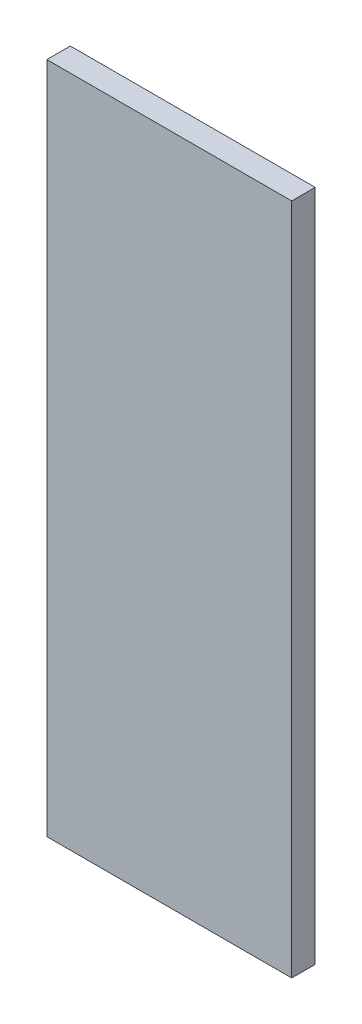
ISO-10303-21;
HEADER;
FILE_DESCRIPTION(('STEP AP214'),'2;1');
FILE_NAME('part.step','',(''),(''),'','','');
FILE_SCHEMA(('AUTOMOTIVE_DESIGN { 1 0 10303 214 1 1 1 1 }'));
ENDSEC;
DATA;
#1=APPLICATION_CONTEXT('core data for automotive mechanical design processes');
#2=APPLICATION_PROTOCOL_DEFINITION('international standard','automotive_design',2000,#1);
#3=PRODUCT_CONTEXT('',#1,'mechanical');
#4=PRODUCT('Part','Part','',(#3));
#5=PRODUCT_RELATED_PRODUCT_CATEGORY('part','',(#4));
#6=PRODUCT_DEFINITION_FORMATION('','',#4);
#7=PRODUCT_DEFINITION_CONTEXT('part definition',#1,'design');
#8=PRODUCT_DEFINITION('design','',#6,#7);
#9=PRODUCT_DEFINITION_SHAPE('','',#8);
#10=(LENGTH_UNIT() NAMED_UNIT(*) SI_UNIT(.MILLI.,.METRE.));
#11=(NAMED_UNIT(*) PLANE_ANGLE_UNIT() SI_UNIT($,.RADIAN.));
#12=(NAMED_UNIT(*) SI_UNIT($,.STERADIAN.) SOLID_ANGLE_UNIT());
#13=UNCERTAINTY_MEASURE_WITH_UNIT(LENGTH_MEASURE(1.E-05),#10,'distance_accuracy_value','');
#14=(GEOMETRIC_REPRESENTATION_CONTEXT(3) GLOBAL_UNCERTAINTY_ASSIGNED_CONTEXT((#13)) GLOBAL_UNIT_ASSIGNED_CONTEXT((#10,
#11,#12)) REPRESENTATION_CONTEXT('',''));
#15=CARTESIAN_POINT('',(0.,0.,0.));
#16=DIRECTION('',(0.,0.,1.));
#17=DIRECTION('',(1.,0.,0.));
#18=AXIS2_PLACEMENT_3D('',#15,#16,#17);
#19=CARTESIAN_POINT('',(0.908095718107407,-0.722568280483534,0.));
#20=DIRECTION('',(1.,0.,0.));
#21=DIRECTION('',(0.,1.,0.));
#22=AXIS2_PLACEMENT_3D('',#19,#20,#21);
#23=PLANE('',#22);
#24=DIRECTION('',(0.,1.,0.));
#25=VECTOR('',#24,1.);
#26=CARTESIAN_POINT('',(0.908095718107407,-0.722568280483534,0.));
#27=LINE('',#26,#25);
#28=CARTESIAN_POINT('',(0.908095718107407,-0.722568280483534,0.));
#29=VERTEX_POINT('',#28);
#30=CARTESIAN_POINT('',(0.908095718107407,-0.636643661734989,0.));
#31=VERTEX_POINT('',#30);
#32=EDGE_CURVE('E11',#29,#31,#27,.T.);
#33=ORIENTED_EDGE('',*,*,#32,.T.);
#34=DIRECTION('',(0.,0.,1.));
#35=VECTOR('',#34,1.);
#36=CARTESIAN_POINT('',(0.908095718107407,-0.636643661734989,0.));
#37=LINE('',#36,#35);
#38=CARTESIAN_POINT('',(0.908095718107407,-0.636643661734989,0.003));
#39=VERTEX_POINT('',#38);
#40=EDGE_CURVE('E24',#31,#39,#37,.T.);
#41=ORIENTED_EDGE('',*,*,#40,.T.);
#42=DIRECTION('',(0.,1.,0.));
#43=VECTOR('',#42,1.);
#44=CARTESIAN_POINT('',(0.908095718107407,-0.722568280483534,0.003));
#45=LINE('',#44,#43);
#46=CARTESIAN_POINT('',(0.908095718107407,-0.722568280483534,0.003));
#47=VERTEX_POINT('',#46);
#48=EDGE_CURVE('E75',#47,#39,#45,.T.);
#49=ORIENTED_EDGE('',*,*,#48,.F.);
#50=DIRECTION('',(0.,0.,1.));
#51=VECTOR('',#50,1.);
#52=CARTESIAN_POINT('',(0.908095718107407,-0.722568280483534,0.));
#53=LINE('',#52,#51);
#54=EDGE_CURVE('E86',#29,#47,#53,.T.);
#55=ORIENTED_EDGE('',*,*,#54,.F.);
#56=EDGE_LOOP('',(#33,#41,#49,#55));
#57=FACE_BOUND('',#56,.T.);
#58=ADVANCED_FACE('F17',(#57),#23,.T.);
#59=CARTESIAN_POINT('',(0.876829654977122,-0.722568280483534,0.));
#60=DIRECTION('',(0.,-1.,0.));
#61=DIRECTION('',(1.,0.,0.));
#62=AXIS2_PLACEMENT_3D('',#59,#60,#61);
#63=PLANE('',#62);
#64=DIRECTION('',(1.,0.,0.));
#65=VECTOR('',#64,1.);
#66=CARTESIAN_POINT('',(0.876829654977122,-0.722568280483534,0.));
#67=LINE('',#66,#65);
#68=CARTESIAN_POINT('',(0.876829654977122,-0.722568280483534,0.));
#69=VERTEX_POINT('',#68);
#70=EDGE_CURVE('E83',#69,#29,#67,.T.);
#71=ORIENTED_EDGE('',*,*,#70,.T.);
#72=ORIENTED_EDGE('',*,*,#54,.T.);
#73=DIRECTION('',(1.,0.,0.));
#74=VECTOR('',#73,1.);
#75=CARTESIAN_POINT('',(0.876829654977122,-0.722568280483534,0.003));
#76=LINE('',#75,#74);
#77=CARTESIAN_POINT('',(0.876829654977122,-0.722568280483534,0.003));
#78=VERTEX_POINT('',#77);
#79=EDGE_CURVE('E81',#78,#47,#76,.T.);
#80=ORIENTED_EDGE('',*,*,#79,.F.);
#81=DIRECTION('',(0.,0.,1.));
#82=VECTOR('',#81,1.);
#83=CARTESIAN_POINT('',(0.876829654977122,-0.722568280483534,0.));
#84=LINE('',#83,#82);
#85=EDGE_CURVE('E61',#69,#78,#84,.T.);
#86=ORIENTED_EDGE('',*,*,#85,.F.);
#87=EDGE_LOOP('',(#71,#72,#80,#86));
#88=FACE_BOUND('',#87,.T.);
#89=ADVANCED_FACE('F91',(#88),#63,.T.);
#90=CARTESIAN_POINT('',(0.876829654977122,-0.636643661734989,0.));
#91=DIRECTION('',(-1.,0.,0.));
#92=DIRECTION('',(0.,-1.,0.));
#93=AXIS2_PLACEMENT_3D('',#90,#91,#92);
#94=PLANE('',#93);
#95=DIRECTION('',(0.,-1.,0.));
#96=VECTOR('',#95,1.);
#97=CARTESIAN_POINT('',(0.876829654977122,-0.636643661734989,0.));
#98=LINE('',#97,#96);
#99=CARTESIAN_POINT('',(0.876829654977122,-0.636643661734989,0.));
#100=VERTEX_POINT('',#99);
#101=EDGE_CURVE('E65',#100,#69,#98,.T.);
#102=ORIENTED_EDGE('',*,*,#101,.T.);
#103=ORIENTED_EDGE('',*,*,#85,.T.);
#104=DIRECTION('',(0.,-1.,0.));
#105=VECTOR('',#104,1.);
#106=CARTESIAN_POINT('',(0.876829654977122,-0.636643661734989,0.003));
#107=LINE('',#106,#105);
#108=CARTESIAN_POINT('',(0.876829654977122,-0.636643661734989,0.003));
#109=VERTEX_POINT('',#108);
#110=EDGE_CURVE('E54',#109,#78,#107,.T.);
#111=ORIENTED_EDGE('',*,*,#110,.F.);
#112=DIRECTION('',(0.,0.,1.));
#113=VECTOR('',#112,1.);
#114=CARTESIAN_POINT('',(0.876829654977122,-0.636643661734989,0.));
#115=LINE('',#114,#113);
#116=EDGE_CURVE('E58',#100,#109,#115,.T.);
#117=ORIENTED_EDGE('',*,*,#116,.F.);
#118=EDGE_LOOP('',(#102,#103,#111,#117));
#119=FACE_BOUND('',#118,.T.);
#120=ADVANCED_FACE('F57',(#119),#94,.T.);
#121=CARTESIAN_POINT('',(0.908095718107407,-0.636643661734989,0.));
#122=DIRECTION('',(0.,1.,0.));
#123=DIRECTION('',(-1.,0.,0.));
#124=AXIS2_PLACEMENT_3D('',#121,#122,#123);
#125=PLANE('',#124);
#126=DIRECTION('',(-1.,0.,0.));
#127=VECTOR('',#126,1.);
#128=CARTESIAN_POINT('',(0.908095718107407,-0.636643661734989,0.));
#129=LINE('',#128,#127);
#130=EDGE_CURVE('E71',#31,#100,#129,.T.);
#131=ORIENTED_EDGE('',*,*,#130,.T.);
#132=ORIENTED_EDGE('',*,*,#116,.T.);
#133=DIRECTION('',(-1.,0.,0.));
#134=VECTOR('',#133,1.);
#135=CARTESIAN_POINT('',(0.908095718107407,-0.636643661734989,0.003));
#136=LINE('',#135,#134);
#137=EDGE_CURVE('E70',#39,#109,#136,.T.);
#138=ORIENTED_EDGE('',*,*,#137,.F.);
#139=ORIENTED_EDGE('',*,*,#40,.F.);
#140=EDGE_LOOP('',(#131,#132,#138,#139));
#141=FACE_BOUND('',#140,.T.);
#142=ADVANCED_FACE('F69',(#141),#125,.T.);
#143=CARTESIAN_POINT('',(0.892462686542264,-0.679605971109262,0.003));
#144=DIRECTION('',(0.,0.,1.));
#145=DIRECTION('',(1.,0.,0.));
#146=AXIS2_PLACEMENT_3D('',#143,#144,#145);
#147=PLANE('',#146);
#148=ORIENTED_EDGE('',*,*,#137,.T.);
#149=ORIENTED_EDGE('',*,*,#110,.T.);
#150=ORIENTED_EDGE('',*,*,#79,.T.);
#151=ORIENTED_EDGE('',*,*,#48,.T.);
#152=EDGE_LOOP('',(#148,#149,#150,#151));
#153=FACE_BOUND('',#152,.T.);
#154=ADVANCED_FACE('F74',(#153),#147,.T.);
#155=CARTESIAN_POINT('',(0.892462686542264,-0.679605971109262,0.));
#156=DIRECTION('',(0.,0.,1.));
#157=DIRECTION('',(1.,0.,0.));
#158=AXIS2_PLACEMENT_3D('',#155,#156,#157);
#159=PLANE('',#158);
#160=ORIENTED_EDGE('',*,*,#130,.F.);
#161=ORIENTED_EDGE('',*,*,#32,.F.);
#162=ORIENTED_EDGE('',*,*,#70,.F.);
#163=ORIENTED_EDGE('',*,*,#101,.F.);
#164=EDGE_LOOP('',(#160,#161,#162,#163));
#165=FACE_BOUND('',#164,.T.);
#166=ADVANCED_FACE('F89',(#165),#159,.F.);
#167=CLOSED_SHELL('',(#58,#89,#120,#142,#154,#166));
#168=MANIFOLD_SOLID_BREP('B1',#167);
#169=ADVANCED_BREP_SHAPE_REPRESENTATION('',(#18,#168),#14);
#170=SHAPE_DEFINITION_REPRESENTATION(#9,#169);
ENDSEC;
END-ISO-10303-21;
